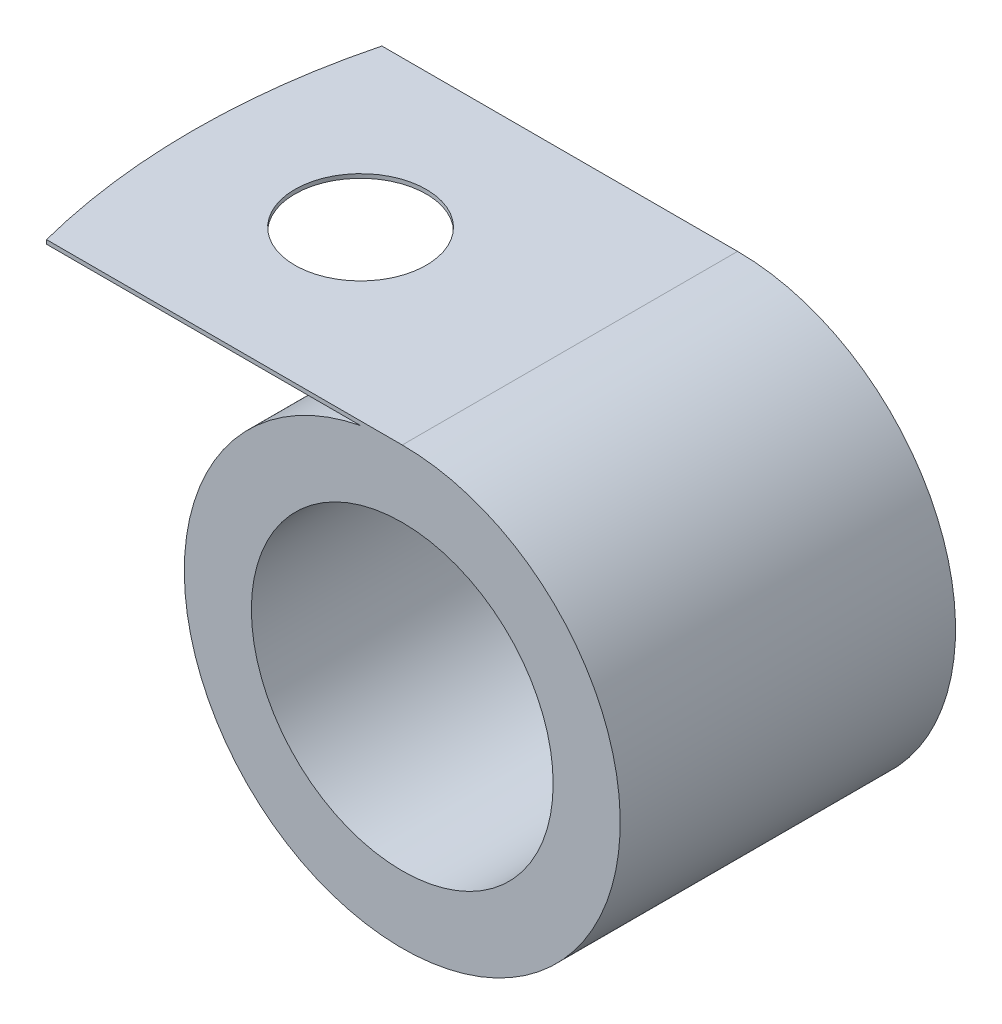
ISO-10303-21;
HEADER;
FILE_DESCRIPTION(('STEP AP214'),'2;1');
FILE_NAME('part.step','',(''),(''),'','','');
FILE_SCHEMA(('AUTOMOTIVE_DESIGN { 1 0 10303 214 1 1 1 1 }'));
ENDSEC;
DATA;
#1=APPLICATION_CONTEXT('core data for automotive mechanical design processes');
#2=APPLICATION_PROTOCOL_DEFINITION('international standard','automotive_design',2000,#1);
#3=PRODUCT_CONTEXT('',#1,'mechanical');
#4=PRODUCT('Part','Part','',(#3));
#5=PRODUCT_RELATED_PRODUCT_CATEGORY('part','',(#4));
#6=PRODUCT_DEFINITION_FORMATION('','',#4);
#7=PRODUCT_DEFINITION_CONTEXT('part definition',#1,'design');
#8=PRODUCT_DEFINITION('design','',#6,#7);
#9=PRODUCT_DEFINITION_SHAPE('','',#8);
#10=(LENGTH_UNIT() NAMED_UNIT(*) SI_UNIT(.MILLI.,.METRE.));
#11=(NAMED_UNIT(*) PLANE_ANGLE_UNIT() SI_UNIT($,.RADIAN.));
#12=(NAMED_UNIT(*) SI_UNIT($,.STERADIAN.) SOLID_ANGLE_UNIT());
#13=UNCERTAINTY_MEASURE_WITH_UNIT(LENGTH_MEASURE(1.E-05),#10,'distance_accuracy_value','');
#14=(GEOMETRIC_REPRESENTATION_CONTEXT(3) GLOBAL_UNCERTAINTY_ASSIGNED_CONTEXT((#13)) GLOBAL_UNIT_ASSIGNED_CONTEXT((#10,
#11,#12)) REPRESENTATION_CONTEXT('',''));
#15=CARTESIAN_POINT('',(0.,0.,0.));
#16=DIRECTION('',(0.,0.,1.));
#17=DIRECTION('',(1.,0.,0.));
#18=AXIS2_PLACEMENT_3D('',#15,#16,#17);
#19=CARTESIAN_POINT('',(0.,8.255,6.35));
#20=DIRECTION('',(0.,-1.,0.));
#21=DIRECTION('',(1.,0.,0.));
#22=AXIS2_PLACEMENT_3D('',#19,#20,#21);
#23=PLANE('',#22);
#24=CARTESIAN_POINT('',(-7.92889145922069,8.255,0.));
#25=DIRECTION('',(0.,1.,0.));
#26=DIRECTION('',(-1.,0.,0.));
#27=AXIS2_PLACEMENT_3D('',#24,#25,#26);
#28=CIRCLE('',#27,2.4892);
#29=CARTESIAN_POINT('',(-10.4180914592207,8.255,0.));
#30=VERTEX_POINT('',#29);
#31=EDGE_CURVE('E100',#30,#30,#28,.T.);
#32=ORIENTED_EDGE('',*,*,#31,.F.);
#33=EDGE_LOOP('',(#32));
#34=FACE_BOUND('',#33,.T.);
#35=CARTESIAN_POINT('',(11.1211085407793,8.255,0.));
#36=DIRECTION('',(0.,1.,0.));
#37=DIRECTION('',(-1.,0.,0.));
#38=AXIS2_PLACEMENT_3D('',#35,#36,#37);
#39=CIRCLE('',#38,25.4);
#40=CARTESIAN_POINT('',(-13.4723357076378,8.255,-6.35));
#41=VERTEX_POINT('',#40);
#42=CARTESIAN_POINT('',(-13.4723357076378,8.255,6.35));
#43=VERTEX_POINT('',#42);
#44=EDGE_CURVE('E106',#41,#43,#39,.T.);
#45=ORIENTED_EDGE('',*,*,#44,.T.);
#46=DIRECTION('',(-1.,0.,0.));
#47=VECTOR('',#46,1.);
#48=CARTESIAN_POINT('',(0.,8.255,6.35));
#49=LINE('',#48,#47);
#50=CARTESIAN_POINT('',(0.,8.255,6.35));
#51=VERTEX_POINT('',#50);
#52=EDGE_CURVE('E93',#51,#43,#49,.T.);
#53=ORIENTED_EDGE('',*,*,#52,.F.);
#54=DIRECTION('',(0.,0.,-1.));
#55=VECTOR('',#54,1.);
#56=CARTESIAN_POINT('',(0.,8.255,6.35));
#57=LINE('',#56,#55);
#58=CARTESIAN_POINT('',(0.,8.255,-6.35));
#59=VERTEX_POINT('',#58);
#60=EDGE_CURVE('E11',#51,#59,#57,.T.);
#61=ORIENTED_EDGE('',*,*,#60,.T.);
#62=DIRECTION('',(-1.,0.,0.));
#63=VECTOR('',#62,1.);
#64=CARTESIAN_POINT('',(0.,8.255,-6.35));
#65=LINE('',#64,#63);
#66=EDGE_CURVE('E77',#59,#41,#65,.T.);
#67=ORIENTED_EDGE('',*,*,#66,.T.);
#68=EDGE_LOOP('',(#45,#53,#61,#67));
#69=FACE_BOUND('',#68,.T.);
#70=ADVANCED_FACE('F32',(#34,#69),#23,.F.);
#71=CARTESIAN_POINT('',(-14.2788914592207,8.1026,6.35));
#72=DIRECTION('',(0.,1.,0.));
#73=DIRECTION('',(0.,0.,1.));
#74=AXIS2_PLACEMENT_3D('',#71,#72,#73);
#75=PLANE('',#74);
#76=CARTESIAN_POINT('',(-7.92889145922069,8.1026,0.));
#77=DIRECTION('',(0.,1.,0.));
#78=DIRECTION('',(0.,0.,1.));
#79=AXIS2_PLACEMENT_3D('',#76,#77,#78);
#80=CIRCLE('',#79,2.4892);
#81=CARTESIAN_POINT('',(-7.92889145922069,8.1026,2.4892));
#82=VERTEX_POINT('',#81);
#83=EDGE_CURVE('E98',#82,#82,#80,.F.);
#84=ORIENTED_EDGE('',*,*,#83,.F.);
#85=EDGE_LOOP('',(#84));
#86=FACE_BOUND('',#85,.T.);
#87=DIRECTION('',(1.,0.,0.));
#88=VECTOR('',#87,1.);
#89=CARTESIAN_POINT('',(-14.2788914592207,8.1026,6.35));
#90=LINE('',#89,#88);
#91=CARTESIAN_POINT('',(-13.4723357076378,8.10259999999999,6.35));
#92=VERTEX_POINT('',#91);
#93=CARTESIAN_POINT('',(-1.57889145922069,8.1026,6.35));
#94=VERTEX_POINT('',#93);
#95=EDGE_CURVE('E56',#92,#94,#90,.T.);
#96=ORIENTED_EDGE('',*,*,#95,.F.);
#97=CARTESIAN_POINT('',(11.1211085407793,8.1026,0.));
#98=DIRECTION('',(0.,1.,0.));
#99=DIRECTION('',(0.,0.,1.));
#100=AXIS2_PLACEMENT_3D('',#97,#98,#99);
#101=CIRCLE('',#100,25.4);
#102=CARTESIAN_POINT('',(-13.4723357076378,8.1026,-6.35));
#103=VERTEX_POINT('',#102);
#104=EDGE_CURVE('E73',#92,#103,#101,.F.);
#105=ORIENTED_EDGE('',*,*,#104,.T.);
#106=DIRECTION('',(1.,0.,0.));
#107=VECTOR('',#106,1.);
#108=CARTESIAN_POINT('',(-14.2788914592207,8.1026,-6.35));
#109=LINE('',#108,#107);
#110=CARTESIAN_POINT('',(-1.57889145922069,8.1026,-6.35));
#111=VERTEX_POINT('',#110);
#112=EDGE_CURVE('E69',#103,#111,#109,.T.);
#113=ORIENTED_EDGE('',*,*,#112,.T.);
#114=DIRECTION('',(0.,0.,-1.));
#115=VECTOR('',#114,1.);
#116=CARTESIAN_POINT('',(-1.57889145922069,8.1026,6.35));
#117=LINE('',#116,#115);
#118=EDGE_CURVE('E40',#94,#111,#117,.T.);
#119=ORIENTED_EDGE('',*,*,#118,.F.);
#120=EDGE_LOOP('',(#96,#105,#113,#119));
#121=FACE_BOUND('',#120,.T.);
#122=ADVANCED_FACE('F71',(#86,#121),#75,.F.);
#123=CARTESIAN_POINT('',(0.,0.,6.35));
#124=DIRECTION('',(0.,0.,1.));
#125=DIRECTION('',(1.,0.,0.));
#126=AXIS2_PLACEMENT_3D('',#123,#124,#125);
#127=PLANE('',#126);
#128=CARTESIAN_POINT('',(0.,0.,6.35));
#129=DIRECTION('',(0.,0.,1.));
#130=DIRECTION('',(1.,0.,0.));
#131=AXIS2_PLACEMENT_3D('',#128,#129,#130);
#132=CIRCLE('',#131,5.715);
#133=CARTESIAN_POINT('',(5.715,0.,6.35));
#134=VERTEX_POINT('',#133);
#135=EDGE_CURVE('E85',#134,#134,#132,.T.);
#136=ORIENTED_EDGE('',*,*,#135,.F.);
#137=EDGE_LOOP('',(#136));
#138=FACE_BOUND('',#137,.T.);
#139=ORIENTED_EDGE('',*,*,#52,.T.);
#140=DIRECTION('',(0.,1.,0.));
#141=VECTOR('',#140,1.);
#142=CARTESIAN_POINT('',(-13.4723357076378,-8.256,6.35));
#143=LINE('',#142,#141);
#144=EDGE_CURVE('E110',#92,#43,#143,.T.);
#145=ORIENTED_EDGE('',*,*,#144,.F.);
#146=ORIENTED_EDGE('',*,*,#95,.T.);
#147=CARTESIAN_POINT('',(0.,0.,6.35));
#148=DIRECTION('',(0.,0.,1.));
#149=DIRECTION('',(1.,0.,0.));
#150=AXIS2_PLACEMENT_3D('',#147,#148,#149);
#151=CIRCLE('',#150,8.255);
#152=EDGE_CURVE('E76',#94,#51,#151,.T.);
#153=ORIENTED_EDGE('',*,*,#152,.T.);
#154=EDGE_LOOP('',(#139,#145,#146,#153));
#155=FACE_BOUND('',#154,.T.);
#156=ADVANCED_FACE('F116',(#138,#155),#127,.T.);
#157=CARTESIAN_POINT('',(0.,0.,-6.35));
#158=DIRECTION('',(0.,0.,1.));
#159=DIRECTION('',(1.,0.,0.));
#160=AXIS2_PLACEMENT_3D('',#157,#158,#159);
#161=PLANE('',#160);
#162=CARTESIAN_POINT('',(0.,0.,-6.35));
#163=DIRECTION('',(0.,0.,1.));
#164=DIRECTION('',(1.,0.,0.));
#165=AXIS2_PLACEMENT_3D('',#162,#163,#164);
#166=CIRCLE('',#165,5.715);
#167=CARTESIAN_POINT('',(5.715,0.,-6.35));
#168=VERTEX_POINT('',#167);
#169=EDGE_CURVE('E89',#168,#168,#166,.T.);
#170=ORIENTED_EDGE('',*,*,#169,.T.);
#171=EDGE_LOOP('',(#170));
#172=FACE_BOUND('',#171,.T.);
#173=DIRECTION('',(0.,1.,0.));
#174=VECTOR('',#173,1.);
#175=CARTESIAN_POINT('',(-13.4723357076378,-8.256,-6.35));
#176=LINE('',#175,#174);
#177=EDGE_CURVE('E47',#103,#41,#176,.T.);
#178=ORIENTED_EDGE('',*,*,#177,.T.);
#179=ORIENTED_EDGE('',*,*,#66,.F.);
#180=CARTESIAN_POINT('',(0.,0.,-6.35));
#181=DIRECTION('',(0.,0.,1.));
#182=DIRECTION('',(1.,0.,0.));
#183=AXIS2_PLACEMENT_3D('',#180,#181,#182);
#184=CIRCLE('',#183,8.255);
#185=EDGE_CURVE('E82',#111,#59,#184,.T.);
#186=ORIENTED_EDGE('',*,*,#185,.F.);
#187=ORIENTED_EDGE('',*,*,#112,.F.);
#188=EDGE_LOOP('',(#178,#179,#186,#187));
#189=FACE_BOUND('',#188,.T.);
#190=ADVANCED_FACE('F83',(#172,#189),#161,.F.);
#191=CARTESIAN_POINT('',(0.,0.,6.35));
#192=DIRECTION('',(0.,0.,-1.));
#193=DIRECTION('',(-1.,0.,0.));
#194=AXIS2_PLACEMENT_3D('',#191,#192,#193);
#195=CYLINDRICAL_SURFACE('',#194,8.255);
#196=ORIENTED_EDGE('',*,*,#185,.T.);
#197=ORIENTED_EDGE('',*,*,#60,.F.);
#198=ORIENTED_EDGE('',*,*,#152,.F.);
#199=ORIENTED_EDGE('',*,*,#118,.T.);
#200=EDGE_LOOP('',(#196,#197,#198,#199));
#201=FACE_BOUND('',#200,.T.);
#202=ADVANCED_FACE('F34',(#201),#195,.T.);
#203=CARTESIAN_POINT('',(0.,0.,6.35));
#204=DIRECTION('',(0.,0.,-1.));
#205=DIRECTION('',(-1.,0.,0.));
#206=AXIS2_PLACEMENT_3D('',#203,#204,#205);
#207=CYLINDRICAL_SURFACE('',#206,5.715);
#208=ORIENTED_EDGE('',*,*,#135,.T.);
#209=EDGE_LOOP('',(#208));
#210=FACE_BOUND('',#209,.T.);
#211=ORIENTED_EDGE('',*,*,#169,.F.);
#212=EDGE_LOOP('',(#211));
#213=FACE_BOUND('',#212,.T.);
#214=ADVANCED_FACE('F134',(#210,#213),#207,.F.);
#215=CARTESIAN_POINT('',(-7.92889145922069,-8.256,0.));
#216=DIRECTION('',(0.,1.,0.));
#217=DIRECTION('',(-1.,0.,0.));
#218=AXIS2_PLACEMENT_3D('',#215,#216,#217);
#219=CYLINDRICAL_SURFACE('',#218,2.4892);
#220=ORIENTED_EDGE('',*,*,#31,.T.);
#221=EDGE_LOOP('',(#220));
#222=FACE_BOUND('',#221,.T.);
#223=ORIENTED_EDGE('',*,*,#83,.T.);
#224=EDGE_LOOP('',(#223));
#225=FACE_BOUND('',#224,.T.);
#226=ADVANCED_FACE('F137',(#222,#225),#219,.F.);
#227=CARTESIAN_POINT('',(11.1211085407793,-8.256,0.));
#228=DIRECTION('',(0.,1.,0.));
#229=DIRECTION('',(-1.,0.,0.));
#230=AXIS2_PLACEMENT_3D('',#227,#228,#229);
#231=CYLINDRICAL_SURFACE('',#230,25.4);
#232=ORIENTED_EDGE('',*,*,#104,.F.);
#233=ORIENTED_EDGE('',*,*,#144,.T.);
#234=ORIENTED_EDGE('',*,*,#44,.F.);
#235=ORIENTED_EDGE('',*,*,#177,.F.);
#236=EDGE_LOOP('',(#232,#233,#234,#235));
#237=FACE_BOUND('',#236,.T.);
#238=ADVANCED_FACE('F113',(#237),#231,.T.);
#239=CLOSED_SHELL('',(#70,#122,#156,#190,#202,#214,#226,#238));
#240=MANIFOLD_SOLID_BREP('B2',#239);
#241=ADVANCED_BREP_SHAPE_REPRESENTATION('',(#18,#240),#14);
#242=SHAPE_DEFINITION_REPRESENTATION(#9,#241);
ENDSEC;
END-ISO-10303-21;
